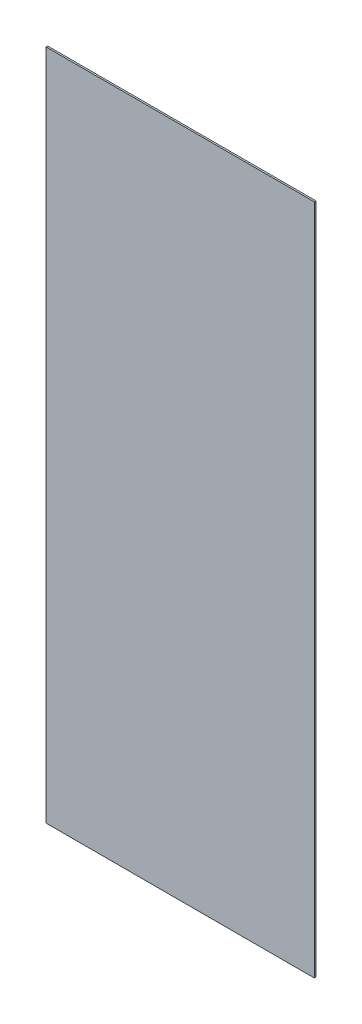
ISO-10303-21;
HEADER;
FILE_DESCRIPTION(('STEP AP214'),'2;1');
FILE_NAME('part.step','',(''),(''),'','','');
FILE_SCHEMA(('AUTOMOTIVE_DESIGN { 1 0 10303 214 1 1 1 1 }'));
ENDSEC;
DATA;
#1=APPLICATION_CONTEXT('core data for automotive mechanical design processes');
#2=APPLICATION_PROTOCOL_DEFINITION('international standard','automotive_design',2000,#1);
#3=PRODUCT_CONTEXT('',#1,'mechanical');
#4=PRODUCT('Part','Part','',(#3));
#5=PRODUCT_RELATED_PRODUCT_CATEGORY('part','',(#4));
#6=PRODUCT_DEFINITION_FORMATION('','',#4);
#7=PRODUCT_DEFINITION_CONTEXT('part definition',#1,'design');
#8=PRODUCT_DEFINITION('design','',#6,#7);
#9=PRODUCT_DEFINITION_SHAPE('','',#8);
#10=(LENGTH_UNIT() NAMED_UNIT(*) SI_UNIT(.MILLI.,.METRE.));
#11=(NAMED_UNIT(*) PLANE_ANGLE_UNIT() SI_UNIT($,.RADIAN.));
#12=(NAMED_UNIT(*) SI_UNIT($,.STERADIAN.) SOLID_ANGLE_UNIT());
#13=UNCERTAINTY_MEASURE_WITH_UNIT(LENGTH_MEASURE(1.E-05),#10,'distance_accuracy_value','');
#14=(GEOMETRIC_REPRESENTATION_CONTEXT(3) GLOBAL_UNCERTAINTY_ASSIGNED_CONTEXT((#13)) GLOBAL_UNIT_ASSIGNED_CONTEXT((#10,
#11,#12)) REPRESENTATION_CONTEXT('',''));
#15=CARTESIAN_POINT('',(0.,0.,0.));
#16=DIRECTION('',(0.,0.,1.));
#17=DIRECTION('',(1.,0.,0.));
#18=AXIS2_PLACEMENT_3D('',#15,#16,#17);
#19=CARTESIAN_POINT('',(-60.4838709677414,315.876935862367,1.));
#20=DIRECTION('',(1.,0.,0.));
#21=DIRECTION('',(0.,0.,-1.));
#22=AXIS2_PLACEMENT_3D('',#19,#20,#21);
#23=PLANE('',#22);
#24=DIRECTION('',(0.,-1.,0.));
#25=VECTOR('',#24,1.);
#26=CARTESIAN_POINT('',(-60.4838709677414,315.876935862367,0.));
#27=LINE('',#26,#25);
#28=CARTESIAN_POINT('',(-60.4838709677414,315.876935862367,0.));
#29=VERTEX_POINT('',#28);
#30=CARTESIAN_POINT('',(-60.4838709677414,-95.1230641376344,0.));
#31=VERTEX_POINT('',#30);
#32=EDGE_CURVE('E102',#29,#31,#27,.T.);
#33=ORIENTED_EDGE('',*,*,#32,.T.);
#34=DIRECTION('',(0.,0.,-1.));
#35=VECTOR('',#34,1.);
#36=CARTESIAN_POINT('',(-60.4838709677414,-95.1230641376344,1.));
#37=LINE('',#36,#35);
#38=CARTESIAN_POINT('',(-60.4838709677414,-95.1230641376344,1.));
#39=VERTEX_POINT('',#38);
#40=EDGE_CURVE('E11',#39,#31,#37,.T.);
#41=ORIENTED_EDGE('',*,*,#40,.F.);
#42=DIRECTION('',(0.,-1.,0.));
#43=VECTOR('',#42,1.);
#44=CARTESIAN_POINT('',(-60.4838709677414,315.876935862367,1.));
#45=LINE('',#44,#43);
#46=CARTESIAN_POINT('',(-60.4838709677414,315.876935862367,1.));
#47=VERTEX_POINT('',#46);
#48=EDGE_CURVE('E90',#47,#39,#45,.T.);
#49=ORIENTED_EDGE('',*,*,#48,.F.);
#50=DIRECTION('',(0.,0.,-1.));
#51=VECTOR('',#50,1.);
#52=CARTESIAN_POINT('',(-60.4838709677414,315.876935862367,1.));
#53=LINE('',#52,#51);
#54=EDGE_CURVE('E98',#47,#29,#53,.T.);
#55=ORIENTED_EDGE('',*,*,#54,.T.);
#56=EDGE_LOOP('',(#33,#41,#49,#55));
#57=FACE_BOUND('',#56,.T.);
#58=ADVANCED_FACE('F39',(#57),#23,.F.);
#59=CARTESIAN_POINT('',(-60.4838709677414,-95.1230641376344,1.));
#60=DIRECTION('',(0.,1.,0.));
#61=DIRECTION('',(0.,0.,1.));
#62=AXIS2_PLACEMENT_3D('',#59,#60,#61);
#63=PLANE('',#62);
#64=DIRECTION('',(1.,0.,0.));
#65=VECTOR('',#64,1.);
#66=CARTESIAN_POINT('',(-60.4838709677414,-95.1230641376344,0.));
#67=LINE('',#66,#65);
#68=CARTESIAN_POINT('',(103.516129032257,-95.1230641376344,0.));
#69=VERTEX_POINT('',#68);
#70=EDGE_CURVE('E94',#31,#69,#67,.T.);
#71=ORIENTED_EDGE('',*,*,#70,.T.);
#72=DIRECTION('',(0.,0.,-1.));
#73=VECTOR('',#72,1.);
#74=CARTESIAN_POINT('',(103.516129032257,-95.1230641376344,1.));
#75=LINE('',#74,#73);
#76=CARTESIAN_POINT('',(103.516129032257,-95.1230641376344,1.));
#77=VERTEX_POINT('',#76);
#78=EDGE_CURVE('E47',#77,#69,#75,.T.);
#79=ORIENTED_EDGE('',*,*,#78,.F.);
#80=DIRECTION('',(1.,0.,0.));
#81=VECTOR('',#80,1.);
#82=CARTESIAN_POINT('',(-60.4838709677414,-95.1230641376344,1.));
#83=LINE('',#82,#81);
#84=EDGE_CURVE('E85',#39,#77,#83,.T.);
#85=ORIENTED_EDGE('',*,*,#84,.F.);
#86=ORIENTED_EDGE('',*,*,#40,.T.);
#87=EDGE_LOOP('',(#71,#79,#85,#86));
#88=FACE_BOUND('',#87,.T.);
#89=ADVANCED_FACE('F93',(#88),#63,.F.);
#90=CARTESIAN_POINT('',(103.516129032257,315.876935862367,1.));
#91=DIRECTION('',(-1.,0.,0.));
#92=DIRECTION('',(0.,0.,1.));
#93=AXIS2_PLACEMENT_3D('',#90,#91,#92);
#94=PLANE('',#93);
#95=DIRECTION('',(0.,1.,0.));
#96=VECTOR('',#95,1.);
#97=CARTESIAN_POINT('',(103.516129032257,315.876935862367,0.));
#98=LINE('',#97,#96);
#99=CARTESIAN_POINT('',(103.516129032257,315.876935862367,0.));
#100=VERTEX_POINT('',#99);
#101=EDGE_CURVE('E72',#69,#100,#98,.T.);
#102=ORIENTED_EDGE('',*,*,#101,.T.);
#103=DIRECTION('',(0.,0.,-1.));
#104=VECTOR('',#103,1.);
#105=CARTESIAN_POINT('',(103.516129032257,315.876935862367,1.));
#106=LINE('',#105,#104);
#107=CARTESIAN_POINT('',(103.516129032257,315.876935862367,1.));
#108=VERTEX_POINT('',#107);
#109=EDGE_CURVE('E95',#108,#100,#106,.T.);
#110=ORIENTED_EDGE('',*,*,#109,.F.);
#111=DIRECTION('',(0.,1.,0.));
#112=VECTOR('',#111,1.);
#113=CARTESIAN_POINT('',(103.516129032257,315.876935862367,1.));
#114=LINE('',#113,#112);
#115=EDGE_CURVE('E88',#77,#108,#114,.T.);
#116=ORIENTED_EDGE('',*,*,#115,.F.);
#117=ORIENTED_EDGE('',*,*,#78,.T.);
#118=EDGE_LOOP('',(#102,#110,#116,#117));
#119=FACE_BOUND('',#118,.T.);
#120=ADVANCED_FACE('F96',(#119),#94,.F.);
#121=CARTESIAN_POINT('',(-60.4838709677414,315.876935862367,1.));
#122=DIRECTION('',(0.,-1.,0.));
#123=DIRECTION('',(0.,0.,-1.));
#124=AXIS2_PLACEMENT_3D('',#121,#122,#123);
#125=PLANE('',#124);
#126=DIRECTION('',(-1.,0.,0.));
#127=VECTOR('',#126,1.);
#128=CARTESIAN_POINT('',(-60.4838709677414,315.876935862367,0.));
#129=LINE('',#128,#127);
#130=EDGE_CURVE('E78',#100,#29,#129,.T.);
#131=ORIENTED_EDGE('',*,*,#130,.T.);
#132=ORIENTED_EDGE('',*,*,#54,.F.);
#133=DIRECTION('',(-1.,0.,0.));
#134=VECTOR('',#133,1.);
#135=CARTESIAN_POINT('',(-60.4838709677414,315.876935862367,1.));
#136=LINE('',#135,#134);
#137=EDGE_CURVE('E55',#108,#47,#136,.T.);
#138=ORIENTED_EDGE('',*,*,#137,.F.);
#139=ORIENTED_EDGE('',*,*,#109,.T.);
#140=EDGE_LOOP('',(#131,#132,#138,#139));
#141=FACE_BOUND('',#140,.T.);
#142=ADVANCED_FACE('F109',(#141),#125,.F.);
#143=CARTESIAN_POINT('',(0.,0.,1.));
#144=DIRECTION('',(0.,0.,1.));
#145=DIRECTION('',(1.,0.,0.));
#146=AXIS2_PLACEMENT_3D('',#143,#144,#145);
#147=PLANE('',#146);
#148=ORIENTED_EDGE('',*,*,#48,.T.);
#149=ORIENTED_EDGE('',*,*,#84,.T.);
#150=ORIENTED_EDGE('',*,*,#115,.T.);
#151=ORIENTED_EDGE('',*,*,#137,.T.);
#152=EDGE_LOOP('',(#148,#149,#150,#151));
#153=FACE_BOUND('',#152,.T.);
#154=ADVANCED_FACE('F86',(#153),#147,.T.);
#155=CARTESIAN_POINT('',(0.,0.,0.));
#156=DIRECTION('',(0.,0.,1.));
#157=DIRECTION('',(1.,0.,0.));
#158=AXIS2_PLACEMENT_3D('',#155,#156,#157);
#159=PLANE('',#158);
#160=ORIENTED_EDGE('',*,*,#32,.F.);
#161=ORIENTED_EDGE('',*,*,#130,.F.);
#162=ORIENTED_EDGE('',*,*,#101,.F.);
#163=ORIENTED_EDGE('',*,*,#70,.F.);
#164=EDGE_LOOP('',(#160,#161,#162,#163));
#165=FACE_BOUND('',#164,.T.);
#166=ADVANCED_FACE('F112',(#165),#159,.F.);
#167=CLOSED_SHELL('',(#58,#89,#120,#142,#154,#166));
#168=MANIFOLD_SOLID_BREP('B2',#167);
#169=ADVANCED_BREP_SHAPE_REPRESENTATION('',(#18,#168),#14);
#170=SHAPE_DEFINITION_REPRESENTATION(#9,#169);
ENDSEC;
END-ISO-10303-21;
